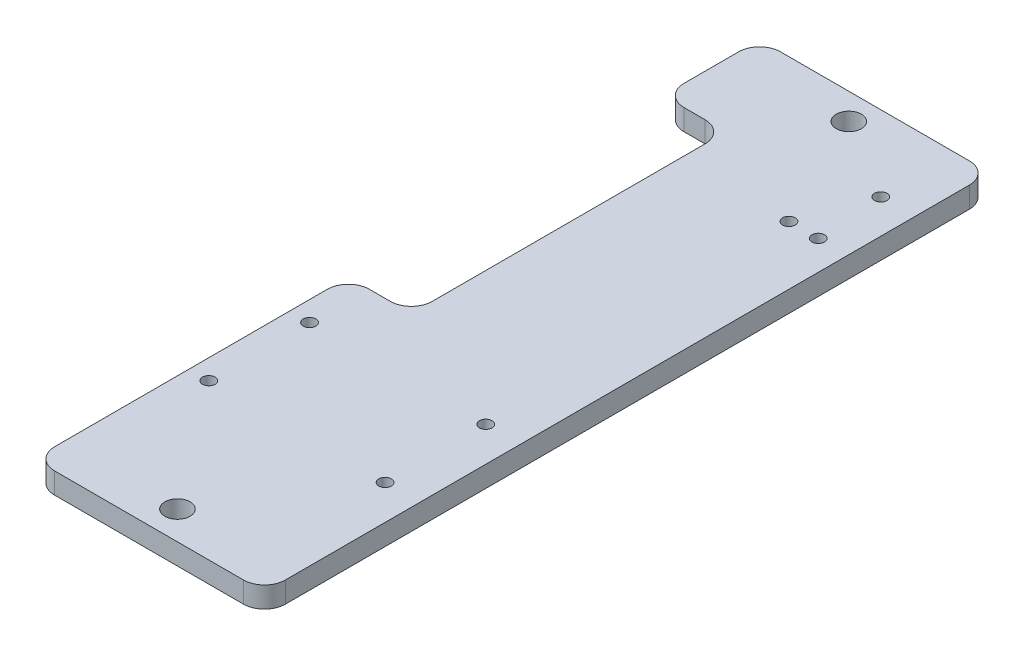
ISO-10303-21;
HEADER;
FILE_DESCRIPTION(('STEP AP214'),'2;1');
FILE_NAME('part.step','',(''),(''),'','','');
FILE_SCHEMA(('AUTOMOTIVE_DESIGN { 1 0 10303 214 1 1 1 1 }'));
ENDSEC;
DATA;
#1=APPLICATION_CONTEXT('core data for automotive mechanical design processes');
#2=APPLICATION_PROTOCOL_DEFINITION('international standard','automotive_design',2000,#1);
#3=PRODUCT_CONTEXT('',#1,'mechanical');
#4=PRODUCT('Part','Part','',(#3));
#5=PRODUCT_RELATED_PRODUCT_CATEGORY('part','',(#4));
#6=PRODUCT_DEFINITION_FORMATION('','',#4);
#7=PRODUCT_DEFINITION_CONTEXT('part definition',#1,'design');
#8=PRODUCT_DEFINITION('design','',#6,#7);
#9=PRODUCT_DEFINITION_SHAPE('','',#8);
#10=(LENGTH_UNIT() NAMED_UNIT(*) SI_UNIT(.MILLI.,.METRE.));
#11=(NAMED_UNIT(*) PLANE_ANGLE_UNIT() SI_UNIT($,.RADIAN.));
#12=(NAMED_UNIT(*) SI_UNIT($,.STERADIAN.) SOLID_ANGLE_UNIT());
#13=UNCERTAINTY_MEASURE_WITH_UNIT(LENGTH_MEASURE(1.E-05),#10,'distance_accuracy_value','');
#14=(GEOMETRIC_REPRESENTATION_CONTEXT(3) GLOBAL_UNCERTAINTY_ASSIGNED_CONTEXT((#13)) GLOBAL_UNIT_ASSIGNED_CONTEXT((#10,
#11,#12)) REPRESENTATION_CONTEXT('',''));
#15=CARTESIAN_POINT('',(0.,0.,0.));
#16=DIRECTION('',(0.,0.,1.));
#17=DIRECTION('',(1.,0.,0.));
#18=AXIS2_PLACEMENT_3D('',#15,#16,#17);
#19=CARTESIAN_POINT('',(0.,5.,0.));
#20=DIRECTION('',(0.,-1.,0.));
#21=DIRECTION('',(0.,0.,-1.));
#22=AXIS2_PLACEMENT_3D('',#19,#20,#21);
#23=PLANE('',#22);
#24=CARTESIAN_POINT('',(191.,5.,-126.));
#25=DIRECTION('',(0.,1.,0.));
#26=DIRECTION('',(0.,0.,1.));
#27=AXIS2_PLACEMENT_3D('',#24,#25,#26);
#28=CIRCLE('',#27,1.5);
#29=CARTESIAN_POINT('',(191.,5.,-124.5));
#30=VERTEX_POINT('',#29);
#31=EDGE_CURVE('E306',#30,#30,#28,.T.);
#32=ORIENTED_EDGE('',*,*,#31,.F.);
#33=EDGE_LOOP('',(#32));
#34=FACE_BOUND('',#33,.T.);
#35=CARTESIAN_POINT('',(196.89,5.,-142.));
#36=DIRECTION('',(0.,1.,0.));
#37=DIRECTION('',(0.,0.,1.));
#38=AXIS2_PLACEMENT_3D('',#35,#36,#37);
#39=CIRCLE('',#38,1.5);
#40=CARTESIAN_POINT('',(196.89,5.,-140.5));
#41=VERTEX_POINT('',#40);
#42=EDGE_CURVE('E310',#41,#41,#39,.T.);
#43=ORIENTED_EDGE('',*,*,#42,.F.);
#44=EDGE_LOOP('',(#43));
#45=FACE_BOUND('',#44,.T.);
#46=CARTESIAN_POINT('',(196.75,5.,-48.));
#47=DIRECTION('',(0.,1.,0.));
#48=DIRECTION('',(0.,0.,1.));
#49=AXIS2_PLACEMENT_3D('',#46,#47,#48);
#50=CIRCLE('',#49,1.5);
#51=CARTESIAN_POINT('',(196.75,5.,-46.5));
#52=VERTEX_POINT('',#51);
#53=EDGE_CURVE('E313',#52,#52,#50,.T.);
#54=ORIENTED_EDGE('',*,*,#53,.F.);
#55=EDGE_LOOP('',(#54));
#56=FACE_BOUND('',#55,.T.);
#57=CARTESIAN_POINT('',(154.75,5.,-48.));
#58=DIRECTION('',(0.,1.,0.));
#59=DIRECTION('',(0.,0.,1.));
#60=AXIS2_PLACEMENT_3D('',#57,#58,#59);
#61=CIRCLE('',#60,1.5);
#62=CARTESIAN_POINT('',(154.75,5.,-46.5));
#63=VERTEX_POINT('',#62);
#64=EDGE_CURVE('E316',#63,#63,#61,.T.);
#65=ORIENTED_EDGE('',*,*,#64,.F.);
#66=EDGE_LOOP('',(#65));
#67=FACE_BOUND('',#66,.T.);
#68=CARTESIAN_POINT('',(196.75,5.,-24.));
#69=DIRECTION('',(0.,1.,0.));
#70=DIRECTION('',(0.,0.,1.));
#71=AXIS2_PLACEMENT_3D('',#68,#69,#70);
#72=CIRCLE('',#71,1.5);
#73=CARTESIAN_POINT('',(196.75,5.,-22.5));
#74=VERTEX_POINT('',#73);
#75=EDGE_CURVE('E319',#74,#74,#72,.T.);
#76=ORIENTED_EDGE('',*,*,#75,.F.);
#77=EDGE_LOOP('',(#76));
#78=FACE_BOUND('',#77,.T.);
#79=CARTESIAN_POINT('',(154.75,5.,-24.));
#80=DIRECTION('',(0.,1.,0.));
#81=DIRECTION('',(0.,0.,1.));
#82=AXIS2_PLACEMENT_3D('',#79,#80,#81);
#83=CIRCLE('',#82,1.5);
#84=CARTESIAN_POINT('',(154.75,5.,-22.5));
#85=VERTEX_POINT('',#84);
#86=EDGE_CURVE('E303',#85,#85,#83,.T.);
#87=ORIENTED_EDGE('',*,*,#86,.F.);
#88=EDGE_LOOP('',(#87));
#89=FACE_BOUND('',#88,.T.);
#90=CARTESIAN_POINT('',(198.,5.,-126.));
#91=DIRECTION('',(0.,1.,0.));
#92=DIRECTION('',(0.,0.,1.));
#93=AXIS2_PLACEMENT_3D('',#90,#91,#92);
#94=CIRCLE('',#93,1.5);
#95=CARTESIAN_POINT('',(198.,5.,-124.5));
#96=VERTEX_POINT('',#95);
#97=EDGE_CURVE('E309',#96,#96,#94,.T.);
#98=ORIENTED_EDGE('',*,*,#97,.F.);
#99=EDGE_LOOP('',(#98));
#100=FACE_BOUND('',#99,.T.);
#101=CARTESIAN_POINT('',(177.5,5.,6.23000000000001));
#102=DIRECTION('',(0.,1.,0.));
#103=DIRECTION('',(0.,0.,-1.));
#104=AXIS2_PLACEMENT_3D('',#101,#102,#103);
#105=CIRCLE('',#104,2.99999999999999);
#106=CARTESIAN_POINT('',(177.5,5.,3.23000000000002));
#107=VERTEX_POINT('',#106);
#108=EDGE_CURVE('E287',#107,#107,#105,.T.);
#109=ORIENTED_EDGE('',*,*,#108,.F.);
#110=EDGE_LOOP('',(#109));
#111=FACE_BOUND('',#110,.T.);
#112=CARTESIAN_POINT('',(177.5,5.,-153.77));
#113=DIRECTION('',(0.,1.,0.));
#114=DIRECTION('',(0.,0.,1.));
#115=AXIS2_PLACEMENT_3D('',#112,#113,#114);
#116=CIRCLE('',#115,2.99999999999999);
#117=CARTESIAN_POINT('',(177.5,5.,-150.77));
#118=VERTEX_POINT('',#117);
#119=EDGE_CURVE('E290',#118,#118,#116,.T.);
#120=ORIENTED_EDGE('',*,*,#119,.F.);
#121=EDGE_LOOP('',(#120));
#122=FACE_BOUND('',#121,.T.);
#123=DIRECTION('',(1.,0.,0.));
#124=VECTOR('',#123,1.);
#125=CARTESIAN_POINT('',(150.,5.,-62.));
#126=LINE('',#125,#124);
#127=CARTESIAN_POINT('',(155.,5.,-62.));
#128=VERTEX_POINT('',#127);
#129=CARTESIAN_POINT('',(160.,5.,-62.));
#130=VERTEX_POINT('',#129);
#131=EDGE_CURVE('E245',#128,#130,#126,.T.);
#132=ORIENTED_EDGE('',*,*,#131,.F.);
#133=CARTESIAN_POINT('',(155.,5.,-57.));
#134=DIRECTION('',(0.,-1.,0.));
#135=DIRECTION('',(0.,0.,-1.));
#136=AXIS2_PLACEMENT_3D('',#133,#134,#135);
#137=CIRCLE('',#136,5.);
#138=CARTESIAN_POINT('',(150.,5.,-57.));
#139=VERTEX_POINT('',#138);
#140=EDGE_CURVE('E237',#128,#139,#137,.F.);
#141=ORIENTED_EDGE('',*,*,#140,.T.);
#142=DIRECTION('',(0.,0.,-1.));
#143=VECTOR('',#142,1.);
#144=CARTESIAN_POINT('',(150.,5.,-50.));
#145=LINE('',#144,#143);
#146=CARTESIAN_POINT('',(150.,5.,7.99999999999998));
#147=VERTEX_POINT('',#146);
#148=EDGE_CURVE('E153',#147,#139,#145,.T.);
#149=ORIENTED_EDGE('',*,*,#148,.F.);
#150=CARTESIAN_POINT('',(155.,5.,7.99999999999998));
#151=DIRECTION('',(0.,-1.,0.));
#152=DIRECTION('',(0.,0.,-1.));
#153=AXIS2_PLACEMENT_3D('',#150,#151,#152);
#154=CIRCLE('',#153,5.);
#155=CARTESIAN_POINT('',(155.,5.,13.));
#156=VERTEX_POINT('',#155);
#157=EDGE_CURVE('E148',#147,#156,#154,.F.);
#158=ORIENTED_EDGE('',*,*,#157,.T.);
#159=DIRECTION('',(1.,0.,0.));
#160=VECTOR('',#159,1.);
#161=CARTESIAN_POINT('',(150.,5.,13.));
#162=LINE('',#161,#160);
#163=CARTESIAN_POINT('',(200.,5.,13.));
#164=VERTEX_POINT('',#163);
#165=EDGE_CURVE('E151',#156,#164,#162,.T.);
#166=ORIENTED_EDGE('',*,*,#165,.T.);
#167=CARTESIAN_POINT('',(200.,5.,7.99999999999998));
#168=DIRECTION('',(0.,-1.,0.));
#169=DIRECTION('',(0.,0.,-1.));
#170=AXIS2_PLACEMENT_3D('',#167,#168,#169);
#171=CIRCLE('',#170,5.);
#172=CARTESIAN_POINT('',(205.,5.,7.99999999999998));
#173=VERTEX_POINT('',#172);
#174=EDGE_CURVE('E158',#164,#173,#171,.F.);
#175=ORIENTED_EDGE('',*,*,#174,.T.);
#176=DIRECTION('',(0.,0.,-1.));
#177=VECTOR('',#176,1.);
#178=CARTESIAN_POINT('',(205.,5.,5.));
#179=LINE('',#178,#177);
#180=CARTESIAN_POINT('',(205.,5.,-155.));
#181=VERTEX_POINT('',#180);
#182=EDGE_CURVE('E298',#173,#181,#179,.T.);
#183=ORIENTED_EDGE('',*,*,#182,.T.);
#184=CARTESIAN_POINT('',(200.,5.,-155.));
#185=DIRECTION('',(0.,-1.,0.));
#186=DIRECTION('',(0.,0.,-1.));
#187=AXIS2_PLACEMENT_3D('',#184,#185,#186);
#188=CIRCLE('',#187,5.);
#189=CARTESIAN_POINT('',(200.,5.,-160.));
#190=VERTEX_POINT('',#189);
#191=EDGE_CURVE('E178',#181,#190,#188,.F.);
#192=ORIENTED_EDGE('',*,*,#191,.T.);
#193=DIRECTION('',(1.,0.,0.));
#194=VECTOR('',#193,1.);
#195=CARTESIAN_POINT('',(150.,5.,-160.));
#196=LINE('',#195,#194);
#197=CARTESIAN_POINT('',(155.,5.,-160.));
#198=VERTEX_POINT('',#197);
#199=EDGE_CURVE('E278',#198,#190,#196,.T.);
#200=ORIENTED_EDGE('',*,*,#199,.F.);
#201=CARTESIAN_POINT('',(155.,5.,-155.));
#202=DIRECTION('',(0.,-1.,0.));
#203=DIRECTION('',(0.,0.,-1.));
#204=AXIS2_PLACEMENT_3D('',#201,#202,#203);
#205=CIRCLE('',#204,5.);
#206=CARTESIAN_POINT('',(150.,5.,-155.));
#207=VERTEX_POINT('',#206);
#208=EDGE_CURVE('E159',#198,#207,#205,.F.);
#209=ORIENTED_EDGE('',*,*,#208,.T.);
#210=CARTESIAN_POINT('',(150.,5.,-142.));
#211=VERTEX_POINT('',#210);
#212=EDGE_CURVE('E327',#211,#207,#145,.T.);
#213=ORIENTED_EDGE('',*,*,#212,.F.);
#214=CARTESIAN_POINT('',(155.,5.,-142.));
#215=DIRECTION('',(0.,-1.,0.));
#216=DIRECTION('',(0.,0.,-1.));
#217=AXIS2_PLACEMENT_3D('',#214,#215,#216);
#218=CIRCLE('',#217,5.);
#219=CARTESIAN_POINT('',(155.,5.,-137.));
#220=VERTEX_POINT('',#219);
#221=EDGE_CURVE('E235',#211,#220,#218,.F.);
#222=ORIENTED_EDGE('',*,*,#221,.T.);
#223=DIRECTION('',(1.,0.,0.));
#224=VECTOR('',#223,1.);
#225=CARTESIAN_POINT('',(150.,5.,-137.));
#226=LINE('',#225,#224);
#227=CARTESIAN_POINT('',(160.,5.,-137.));
#228=VERTEX_POINT('',#227);
#229=EDGE_CURVE('E693',#220,#228,#226,.T.);
#230=ORIENTED_EDGE('',*,*,#229,.T.);
#231=CARTESIAN_POINT('',(160.,5.,-132.));
#232=DIRECTION('',(0.,-1.,0.));
#233=DIRECTION('',(0.,0.,-1.));
#234=AXIS2_PLACEMENT_3D('',#231,#232,#233);
#235=CIRCLE('',#234,5.);
#236=CARTESIAN_POINT('',(165.,5.,-132.));
#237=VERTEX_POINT('',#236);
#238=EDGE_CURVE('E240',#228,#237,#235,.T.);
#239=ORIENTED_EDGE('',*,*,#238,.T.);
#240=DIRECTION('',(0.,0.,1.));
#241=VECTOR('',#240,1.);
#242=CARTESIAN_POINT('',(165.,5.,-137.));
#243=LINE('',#242,#241);
#244=CARTESIAN_POINT('',(165.,5.,-67.));
#245=VERTEX_POINT('',#244);
#246=EDGE_CURVE('E248',#237,#245,#243,.T.);
#247=ORIENTED_EDGE('',*,*,#246,.T.);
#248=CARTESIAN_POINT('',(160.,5.,-67.));
#249=DIRECTION('',(0.,-1.,0.));
#250=DIRECTION('',(0.,0.,-1.));
#251=AXIS2_PLACEMENT_3D('',#248,#249,#250);
#252=CIRCLE('',#251,5.);
#253=EDGE_CURVE('E43',#245,#130,#252,.T.);
#254=ORIENTED_EDGE('',*,*,#253,.T.);
#255=EDGE_LOOP('',(#132,#141,#149,#158,#166,#175,#183,#192,#200,#209,#213,#222,#230,#239,#247,#254));
#256=FACE_BOUND('',#255,.T.);
#257=ADVANCED_FACE('F35',(#34,#45,#56,#67,#78,#89,#100,#111,#122,#256),#23,.F.);
#258=CARTESIAN_POINT('',(0.,0.,0.));
#259=DIRECTION('',(0.,-1.,0.));
#260=DIRECTION('',(0.,0.,-1.));
#261=AXIS2_PLACEMENT_3D('',#258,#259,#260);
#262=PLANE('',#261);
#263=CARTESIAN_POINT('',(177.5,0.,-153.77));
#264=DIRECTION('',(0.,1.,0.));
#265=DIRECTION('',(0.,0.,1.));
#266=AXIS2_PLACEMENT_3D('',#263,#264,#265);
#267=CIRCLE('',#266,2.99999999999999);
#268=CARTESIAN_POINT('',(177.5,0.,-150.77));
#269=VERTEX_POINT('',#268);
#270=EDGE_CURVE('E170',#269,#269,#267,.T.);
#271=ORIENTED_EDGE('',*,*,#270,.T.);
#272=EDGE_LOOP('',(#271));
#273=FACE_BOUND('',#272,.T.);
#274=CARTESIAN_POINT('',(177.5,0.,6.23000000000001));
#275=DIRECTION('',(0.,1.,0.));
#276=DIRECTION('',(0.,0.,-1.));
#277=AXIS2_PLACEMENT_3D('',#274,#275,#276);
#278=CIRCLE('',#277,2.99999999999999);
#279=CARTESIAN_POINT('',(177.5,0.,3.23000000000002));
#280=VERTEX_POINT('',#279);
#281=EDGE_CURVE('E293',#280,#280,#278,.T.);
#282=ORIENTED_EDGE('',*,*,#281,.T.);
#283=EDGE_LOOP('',(#282));
#284=FACE_BOUND('',#283,.T.);
#285=CARTESIAN_POINT('',(198.,0.,-126.));
#286=DIRECTION('',(0.,-1.,0.));
#287=DIRECTION('',(0.,0.,-1.));
#288=AXIS2_PLACEMENT_3D('',#285,#286,#287);
#289=CIRCLE('',#288,1.5);
#290=CARTESIAN_POINT('',(198.,0.,-127.5));
#291=VERTEX_POINT('',#290);
#292=EDGE_CURVE('E326',#291,#291,#289,.T.);
#293=ORIENTED_EDGE('',*,*,#292,.F.);
#294=EDGE_LOOP('',(#293));
#295=FACE_BOUND('',#294,.T.);
#296=CARTESIAN_POINT('',(154.75,0.,-24.));
#297=DIRECTION('',(0.,-1.,0.));
#298=DIRECTION('',(0.,0.,-1.));
#299=AXIS2_PLACEMENT_3D('',#296,#297,#298);
#300=CIRCLE('',#299,1.5);
#301=CARTESIAN_POINT('',(154.75,0.,-25.5));
#302=VERTEX_POINT('',#301);
#303=EDGE_CURVE('E331',#302,#302,#300,.T.);
#304=ORIENTED_EDGE('',*,*,#303,.F.);
#305=EDGE_LOOP('',(#304));
#306=FACE_BOUND('',#305,.T.);
#307=CARTESIAN_POINT('',(196.75,0.,-24.));
#308=DIRECTION('',(0.,-1.,0.));
#309=DIRECTION('',(0.,0.,-1.));
#310=AXIS2_PLACEMENT_3D('',#307,#308,#309);
#311=CIRCLE('',#310,1.5);
#312=CARTESIAN_POINT('',(196.75,0.,-25.5));
#313=VERTEX_POINT('',#312);
#314=EDGE_CURVE('E334',#313,#313,#311,.T.);
#315=ORIENTED_EDGE('',*,*,#314,.F.);
#316=EDGE_LOOP('',(#315));
#317=FACE_BOUND('',#316,.T.);
#318=CARTESIAN_POINT('',(154.75,0.,-48.));
#319=DIRECTION('',(0.,-1.,0.));
#320=DIRECTION('',(0.,0.,-1.));
#321=AXIS2_PLACEMENT_3D('',#318,#319,#320);
#322=CIRCLE('',#321,1.5);
#323=CARTESIAN_POINT('',(154.75,0.,-49.5));
#324=VERTEX_POINT('',#323);
#325=EDGE_CURVE('E337',#324,#324,#322,.T.);
#326=ORIENTED_EDGE('',*,*,#325,.F.);
#327=EDGE_LOOP('',(#326));
#328=FACE_BOUND('',#327,.T.);
#329=CARTESIAN_POINT('',(196.75,0.,-48.));
#330=DIRECTION('',(0.,-1.,0.));
#331=DIRECTION('',(0.,0.,-1.));
#332=AXIS2_PLACEMENT_3D('',#329,#330,#331);
#333=CIRCLE('',#332,1.5);
#334=CARTESIAN_POINT('',(196.75,0.,-49.5));
#335=VERTEX_POINT('',#334);
#336=EDGE_CURVE('E340',#335,#335,#333,.T.);
#337=ORIENTED_EDGE('',*,*,#336,.F.);
#338=EDGE_LOOP('',(#337));
#339=FACE_BOUND('',#338,.T.);
#340=CARTESIAN_POINT('',(196.89,0.,-142.));
#341=DIRECTION('',(0.,-1.,0.));
#342=DIRECTION('',(0.,0.,-1.));
#343=AXIS2_PLACEMENT_3D('',#340,#341,#342);
#344=CIRCLE('',#343,1.5);
#345=CARTESIAN_POINT('',(196.89,0.,-143.5));
#346=VERTEX_POINT('',#345);
#347=EDGE_CURVE('E342',#346,#346,#344,.T.);
#348=ORIENTED_EDGE('',*,*,#347,.F.);
#349=EDGE_LOOP('',(#348));
#350=FACE_BOUND('',#349,.T.);
#351=CARTESIAN_POINT('',(191.,0.,-126.));
#352=DIRECTION('',(0.,-1.,0.));
#353=DIRECTION('',(0.,0.,-1.));
#354=AXIS2_PLACEMENT_3D('',#351,#352,#353);
#355=CIRCLE('',#354,1.5);
#356=CARTESIAN_POINT('',(191.,0.,-127.5));
#357=VERTEX_POINT('',#356);
#358=EDGE_CURVE('E183',#357,#357,#355,.T.);
#359=ORIENTED_EDGE('',*,*,#358,.F.);
#360=EDGE_LOOP('',(#359));
#361=FACE_BOUND('',#360,.T.);
#362=DIRECTION('',(0.,0.,1.));
#363=VECTOR('',#362,1.);
#364=CARTESIAN_POINT('',(150.,0.,0.));
#365=LINE('',#364,#363);
#366=CARTESIAN_POINT('',(150.,0.,-57.));
#367=VERTEX_POINT('',#366);
#368=CARTESIAN_POINT('',(150.,0.,7.99999999999998));
#369=VERTEX_POINT('',#368);
#370=EDGE_CURVE('E180',#367,#369,#365,.T.);
#371=ORIENTED_EDGE('',*,*,#370,.F.);
#372=CARTESIAN_POINT('',(155.,0.,-57.));
#373=DIRECTION('',(0.,-1.,0.));
#374=DIRECTION('',(0.,0.,-1.));
#375=AXIS2_PLACEMENT_3D('',#372,#373,#374);
#376=CIRCLE('',#375,5.);
#377=CARTESIAN_POINT('',(155.,0.,-62.));
#378=VERTEX_POINT('',#377);
#379=EDGE_CURVE('E233',#367,#378,#376,.T.);
#380=ORIENTED_EDGE('',*,*,#379,.T.);
#381=DIRECTION('',(-1.,0.,0.));
#382=VECTOR('',#381,1.);
#383=CARTESIAN_POINT('',(0.,0.,-61.9999999999999));
#384=LINE('',#383,#382);
#385=CARTESIAN_POINT('',(160.,0.,-62.));
#386=VERTEX_POINT('',#385);
#387=EDGE_CURVE('E257',#386,#378,#384,.T.);
#388=ORIENTED_EDGE('',*,*,#387,.F.);
#389=CARTESIAN_POINT('',(160.,0.,-67.));
#390=DIRECTION('',(0.,-1.,0.));
#391=DIRECTION('',(0.,0.,-1.));
#392=AXIS2_PLACEMENT_3D('',#389,#390,#391);
#393=CIRCLE('',#392,5.);
#394=CARTESIAN_POINT('',(165.,0.,-67.));
#395=VERTEX_POINT('',#394);
#396=EDGE_CURVE('E12',#386,#395,#393,.F.);
#397=ORIENTED_EDGE('',*,*,#396,.T.);
#398=DIRECTION('',(0.,0.,-1.));
#399=VECTOR('',#398,1.);
#400=CARTESIAN_POINT('',(165.,0.,0.));
#401=LINE('',#400,#399);
#402=CARTESIAN_POINT('',(165.,0.,-132.));
#403=VERTEX_POINT('',#402);
#404=EDGE_CURVE('E211',#395,#403,#401,.T.);
#405=ORIENTED_EDGE('',*,*,#404,.T.);
#406=CARTESIAN_POINT('',(160.,0.,-132.));
#407=DIRECTION('',(0.,-1.,0.));
#408=DIRECTION('',(0.,0.,-1.));
#409=AXIS2_PLACEMENT_3D('',#406,#407,#408);
#410=CIRCLE('',#409,5.);
#411=CARTESIAN_POINT('',(160.,0.,-137.));
#412=VERTEX_POINT('',#411);
#413=EDGE_CURVE('E242',#403,#412,#410,.F.);
#414=ORIENTED_EDGE('',*,*,#413,.T.);
#415=DIRECTION('',(-1.,0.,0.));
#416=VECTOR('',#415,1.);
#417=CARTESIAN_POINT('',(0.,0.,-137.));
#418=LINE('',#417,#416);
#419=CARTESIAN_POINT('',(155.,0.,-137.));
#420=VERTEX_POINT('',#419);
#421=EDGE_CURVE('E272',#412,#420,#418,.T.);
#422=ORIENTED_EDGE('',*,*,#421,.T.);
#423=CARTESIAN_POINT('',(155.,0.,-142.));
#424=DIRECTION('',(0.,-1.,0.));
#425=DIRECTION('',(0.,0.,-1.));
#426=AXIS2_PLACEMENT_3D('',#423,#424,#425);
#427=CIRCLE('',#426,5.);
#428=CARTESIAN_POINT('',(150.,0.,-142.));
#429=VERTEX_POINT('',#428);
#430=EDGE_CURVE('E58',#420,#429,#427,.T.);
#431=ORIENTED_EDGE('',*,*,#430,.T.);
#432=CARTESIAN_POINT('',(150.,0.,-155.));
#433=VERTEX_POINT('',#432);
#434=EDGE_CURVE('E176',#433,#429,#365,.T.);
#435=ORIENTED_EDGE('',*,*,#434,.F.);
#436=CARTESIAN_POINT('',(155.,0.,-155.));
#437=DIRECTION('',(0.,-1.,0.));
#438=DIRECTION('',(0.,0.,-1.));
#439=AXIS2_PLACEMENT_3D('',#436,#437,#438);
#440=CIRCLE('',#439,5.);
#441=CARTESIAN_POINT('',(155.,0.,-160.));
#442=VERTEX_POINT('',#441);
#443=EDGE_CURVE('E197',#433,#442,#440,.T.);
#444=ORIENTED_EDGE('',*,*,#443,.T.);
#445=DIRECTION('',(-1.,0.,0.));
#446=VECTOR('',#445,1.);
#447=CARTESIAN_POINT('',(0.,0.,-160.));
#448=LINE('',#447,#446);
#449=CARTESIAN_POINT('',(200.,0.,-160.));
#450=VERTEX_POINT('',#449);
#451=EDGE_CURVE('E281',#450,#442,#448,.T.);
#452=ORIENTED_EDGE('',*,*,#451,.F.);
#453=CARTESIAN_POINT('',(200.,0.,-155.));
#454=DIRECTION('',(0.,-1.,0.));
#455=DIRECTION('',(0.,0.,-1.));
#456=AXIS2_PLACEMENT_3D('',#453,#454,#455);
#457=CIRCLE('',#456,5.);
#458=CARTESIAN_POINT('',(205.,0.,-155.));
#459=VERTEX_POINT('',#458);
#460=EDGE_CURVE('E195',#450,#459,#457,.T.);
#461=ORIENTED_EDGE('',*,*,#460,.T.);
#462=DIRECTION('',(0.,0.,-1.));
#463=VECTOR('',#462,1.);
#464=CARTESIAN_POINT('',(205.,0.,5.));
#465=LINE('',#464,#463);
#466=CARTESIAN_POINT('',(205.,0.,7.99999999999998));
#467=VERTEX_POINT('',#466);
#468=EDGE_CURVE('E300',#467,#459,#465,.T.);
#469=ORIENTED_EDGE('',*,*,#468,.F.);
#470=CARTESIAN_POINT('',(200.,0.,7.99999999999998));
#471=DIRECTION('',(0.,-1.,0.));
#472=DIRECTION('',(0.,0.,-1.));
#473=AXIS2_PLACEMENT_3D('',#470,#471,#472);
#474=CIRCLE('',#473,5.);
#475=CARTESIAN_POINT('',(200.,0.,13.));
#476=VERTEX_POINT('',#475);
#477=EDGE_CURVE('E200',#467,#476,#474,.T.);
#478=ORIENTED_EDGE('',*,*,#477,.T.);
#479=DIRECTION('',(1.,0.,0.));
#480=VECTOR('',#479,1.);
#481=CARTESIAN_POINT('',(150.,0.,13.));
#482=LINE('',#481,#480);
#483=CARTESIAN_POINT('',(155.,0.,13.));
#484=VERTEX_POINT('',#483);
#485=EDGE_CURVE('E169',#484,#476,#482,.T.);
#486=ORIENTED_EDGE('',*,*,#485,.F.);
#487=CARTESIAN_POINT('',(155.,0.,7.99999999999998));
#488=DIRECTION('',(0.,-1.,0.));
#489=DIRECTION('',(0.,0.,-1.));
#490=AXIS2_PLACEMENT_3D('',#487,#488,#489);
#491=CIRCLE('',#490,5.);
#492=EDGE_CURVE('E175',#484,#369,#491,.T.);
#493=ORIENTED_EDGE('',*,*,#492,.T.);
#494=EDGE_LOOP('',(#371,#380,#388,#397,#405,#414,#422,#431,#435,#444,#452,#461,#469,#478,#486,#493));
#495=FACE_BOUND('',#494,.T.);
#496=ADVANCED_FACE('F263',(#273,#284,#295,#306,#317,#328,#339,#350,#361,#495),#262,.T.);
#497=CARTESIAN_POINT('',(150.,-5.,-50.));
#498=DIRECTION('',(1.,0.,0.));
#499=DIRECTION('',(0.,0.,-1.));
#500=AXIS2_PLACEMENT_3D('',#497,#498,#499);
#501=PLANE('',#500);
#502=ORIENTED_EDGE('',*,*,#434,.T.);
#503=DIRECTION('',(0.,-1.,0.));
#504=VECTOR('',#503,1.);
#505=CARTESIAN_POINT('',(150.,5.,-142.));
#506=LINE('',#505,#504);
#507=EDGE_CURVE('E50',#429,#211,#506,.F.);
#508=ORIENTED_EDGE('',*,*,#507,.T.);
#509=ORIENTED_EDGE('',*,*,#212,.T.);
#510=DIRECTION('',(0.,1.,0.));
#511=VECTOR('',#510,1.);
#512=CARTESIAN_POINT('',(150.,-5.,-155.));
#513=LINE('',#512,#511);
#514=EDGE_CURVE('E202',#207,#433,#513,.F.);
#515=ORIENTED_EDGE('',*,*,#514,.T.);
#516=EDGE_LOOP('',(#502,#508,#509,#515));
#517=FACE_BOUND('',#516,.T.);
#518=ADVANCED_FACE('F349',(#517),#501,.F.);
#519=CARTESIAN_POINT('',(205.,0.,5.));
#520=DIRECTION('',(1.,0.,0.));
#521=DIRECTION('',(0.,0.,-1.));
#522=AXIS2_PLACEMENT_3D('',#519,#520,#521);
#523=PLANE('',#522);
#524=ORIENTED_EDGE('',*,*,#182,.F.);
#525=DIRECTION('',(0.,1.,0.));
#526=VECTOR('',#525,1.);
#527=CARTESIAN_POINT('',(205.,0.,7.99999999999998));
#528=LINE('',#527,#526);
#529=EDGE_CURVE('E193',#173,#467,#528,.F.);
#530=ORIENTED_EDGE('',*,*,#529,.T.);
#531=ORIENTED_EDGE('',*,*,#468,.T.);
#532=DIRECTION('',(0.,1.,0.));
#533=VECTOR('',#532,1.);
#534=CARTESIAN_POINT('',(205.,5.,-155.));
#535=LINE('',#534,#533);
#536=EDGE_CURVE('E190',#459,#181,#535,.T.);
#537=ORIENTED_EDGE('',*,*,#536,.T.);
#538=EDGE_LOOP('',(#524,#530,#531,#537));
#539=FACE_BOUND('',#538,.T.);
#540=ADVANCED_FACE('F369',(#539),#523,.T.);
#541=ORIENTED_EDGE('',*,*,#148,.T.);
#542=DIRECTION('',(0.,-1.,0.));
#543=VECTOR('',#542,1.);
#544=CARTESIAN_POINT('',(150.,-5.,-57.));
#545=LINE('',#544,#543);
#546=EDGE_CURVE('E229',#139,#367,#545,.T.);
#547=ORIENTED_EDGE('',*,*,#546,.T.);
#548=ORIENTED_EDGE('',*,*,#370,.T.);
#549=DIRECTION('',(0.,1.,0.));
#550=VECTOR('',#549,1.);
#551=CARTESIAN_POINT('',(150.,5.,7.99999999999998));
#552=LINE('',#551,#550);
#553=EDGE_CURVE('E204',#369,#147,#552,.T.);
#554=ORIENTED_EDGE('',*,*,#553,.T.);
#555=EDGE_LOOP('',(#541,#547,#548,#554));
#556=FACE_BOUND('',#555,.T.);
#557=ADVANCED_FACE('F374',(#556),#501,.F.);
#558=CARTESIAN_POINT('',(198.,-5.,-126.));
#559=DIRECTION('',(0.,1.,0.));
#560=DIRECTION('',(0.,0.,1.));
#561=AXIS2_PLACEMENT_3D('',#558,#559,#560);
#562=CYLINDRICAL_SURFACE('',#561,1.5);
#563=ORIENTED_EDGE('',*,*,#292,.T.);
#564=EDGE_LOOP('',(#563));
#565=FACE_BOUND('',#564,.T.);
#566=ORIENTED_EDGE('',*,*,#97,.T.);
#567=EDGE_LOOP('',(#566));
#568=FACE_BOUND('',#567,.T.);
#569=ADVANCED_FACE('F453',(#565,#568),#562,.F.);
#570=CARTESIAN_POINT('',(154.75,-5.,-24.));
#571=DIRECTION('',(0.,1.,0.));
#572=DIRECTION('',(0.,0.,1.));
#573=AXIS2_PLACEMENT_3D('',#570,#571,#572);
#574=CYLINDRICAL_SURFACE('',#573,1.5);
#575=ORIENTED_EDGE('',*,*,#303,.T.);
#576=EDGE_LOOP('',(#575));
#577=FACE_BOUND('',#576,.T.);
#578=ORIENTED_EDGE('',*,*,#86,.T.);
#579=EDGE_LOOP('',(#578));
#580=FACE_BOUND('',#579,.T.);
#581=ADVANCED_FACE('F450',(#577,#580),#574,.F.);
#582=CARTESIAN_POINT('',(196.75,-5.,-24.));
#583=DIRECTION('',(0.,1.,0.));
#584=DIRECTION('',(0.,0.,1.));
#585=AXIS2_PLACEMENT_3D('',#582,#583,#584);
#586=CYLINDRICAL_SURFACE('',#585,1.5);
#587=ORIENTED_EDGE('',*,*,#314,.T.);
#588=EDGE_LOOP('',(#587));
#589=FACE_BOUND('',#588,.T.);
#590=ORIENTED_EDGE('',*,*,#75,.T.);
#591=EDGE_LOOP('',(#590));
#592=FACE_BOUND('',#591,.T.);
#593=ADVANCED_FACE('F446',(#589,#592),#586,.F.);
#594=CARTESIAN_POINT('',(154.75,-5.,-48.));
#595=DIRECTION('',(0.,1.,0.));
#596=DIRECTION('',(0.,0.,1.));
#597=AXIS2_PLACEMENT_3D('',#594,#595,#596);
#598=CYLINDRICAL_SURFACE('',#597,1.5);
#599=ORIENTED_EDGE('',*,*,#325,.T.);
#600=EDGE_LOOP('',(#599));
#601=FACE_BOUND('',#600,.T.);
#602=ORIENTED_EDGE('',*,*,#64,.T.);
#603=EDGE_LOOP('',(#602));
#604=FACE_BOUND('',#603,.T.);
#605=ADVANCED_FACE('F442',(#601,#604),#598,.F.);
#606=CARTESIAN_POINT('',(196.75,-5.,-48.));
#607=DIRECTION('',(0.,1.,0.));
#608=DIRECTION('',(0.,0.,1.));
#609=AXIS2_PLACEMENT_3D('',#606,#607,#608);
#610=CYLINDRICAL_SURFACE('',#609,1.5);
#611=ORIENTED_EDGE('',*,*,#336,.T.);
#612=EDGE_LOOP('',(#611));
#613=FACE_BOUND('',#612,.T.);
#614=ORIENTED_EDGE('',*,*,#53,.T.);
#615=EDGE_LOOP('',(#614));
#616=FACE_BOUND('',#615,.T.);
#617=ADVANCED_FACE('F439',(#613,#616),#610,.F.);
#618=CARTESIAN_POINT('',(196.89,-5.,-142.));
#619=DIRECTION('',(0.,1.,0.));
#620=DIRECTION('',(0.,0.,1.));
#621=AXIS2_PLACEMENT_3D('',#618,#619,#620);
#622=CYLINDRICAL_SURFACE('',#621,1.5);
#623=ORIENTED_EDGE('',*,*,#347,.T.);
#624=EDGE_LOOP('',(#623));
#625=FACE_BOUND('',#624,.T.);
#626=ORIENTED_EDGE('',*,*,#42,.T.);
#627=EDGE_LOOP('',(#626));
#628=FACE_BOUND('',#627,.T.);
#629=ADVANCED_FACE('F436',(#625,#628),#622,.F.);
#630=CARTESIAN_POINT('',(191.,-5.,-126.));
#631=DIRECTION('',(0.,1.,0.));
#632=DIRECTION('',(0.,0.,1.));
#633=AXIS2_PLACEMENT_3D('',#630,#631,#632);
#634=CYLINDRICAL_SURFACE('',#633,1.5);
#635=ORIENTED_EDGE('',*,*,#358,.T.);
#636=EDGE_LOOP('',(#635));
#637=FACE_BOUND('',#636,.T.);
#638=ORIENTED_EDGE('',*,*,#31,.T.);
#639=EDGE_LOOP('',(#638));
#640=FACE_BOUND('',#639,.T.);
#641=ADVANCED_FACE('F431',(#637,#640),#634,.F.);
#642=CARTESIAN_POINT('',(150.,0.,13.));
#643=DIRECTION('',(0.,0.,1.));
#644=DIRECTION('',(1.,0.,0.));
#645=AXIS2_PLACEMENT_3D('',#642,#643,#644);
#646=PLANE('',#645);
#647=ORIENTED_EDGE('',*,*,#485,.T.);
#648=DIRECTION('',(0.,1.,0.));
#649=VECTOR('',#648,1.);
#650=CARTESIAN_POINT('',(200.,0.,13.));
#651=LINE('',#650,#649);
#652=EDGE_CURVE('E168',#476,#164,#651,.T.);
#653=ORIENTED_EDGE('',*,*,#652,.T.);
#654=ORIENTED_EDGE('',*,*,#165,.F.);
#655=DIRECTION('',(0.,1.,0.));
#656=VECTOR('',#655,1.);
#657=CARTESIAN_POINT('',(155.,0.,13.));
#658=LINE('',#657,#656);
#659=EDGE_CURVE('E165',#156,#484,#658,.F.);
#660=ORIENTED_EDGE('',*,*,#659,.T.);
#661=EDGE_LOOP('',(#647,#653,#654,#660));
#662=FACE_BOUND('',#661,.T.);
#663=ADVANCED_FACE('F164',(#662),#646,.T.);
#664=CARTESIAN_POINT('',(177.5,0.,6.23000000000001));
#665=DIRECTION('',(0.,1.,0.));
#666=DIRECTION('',(0.,0.,1.));
#667=AXIS2_PLACEMENT_3D('',#664,#665,#666);
#668=CYLINDRICAL_SURFACE('',#667,2.99999999999999);
#669=ORIENTED_EDGE('',*,*,#281,.F.);
#670=EDGE_LOOP('',(#669));
#671=FACE_BOUND('',#670,.T.);
#672=ORIENTED_EDGE('',*,*,#108,.T.);
#673=EDGE_LOOP('',(#672));
#674=FACE_BOUND('',#673,.T.);
#675=ADVANCED_FACE('F424',(#671,#674),#668,.F.);
#676=CARTESIAN_POINT('',(177.5,0.,-153.77));
#677=DIRECTION('',(0.,1.,0.));
#678=DIRECTION('',(0.,0.,1.));
#679=AXIS2_PLACEMENT_3D('',#676,#677,#678);
#680=CYLINDRICAL_SURFACE('',#679,2.99999999999999);
#681=ORIENTED_EDGE('',*,*,#270,.F.);
#682=EDGE_LOOP('',(#681));
#683=FACE_BOUND('',#682,.T.);
#684=ORIENTED_EDGE('',*,*,#119,.T.);
#685=EDGE_LOOP('',(#684));
#686=FACE_BOUND('',#685,.T.);
#687=ADVANCED_FACE('F421',(#683,#686),#680,.F.);
#688=CARTESIAN_POINT('',(150.,-34.,-160.));
#689=DIRECTION('',(0.,0.,1.));
#690=DIRECTION('',(1.,0.,0.));
#691=AXIS2_PLACEMENT_3D('',#688,#689,#690);
#692=PLANE('',#691);
#693=ORIENTED_EDGE('',*,*,#451,.T.);
#694=DIRECTION('',(0.,1.,0.));
#695=VECTOR('',#694,1.);
#696=CARTESIAN_POINT('',(155.,-34.,-160.));
#697=LINE('',#696,#695);
#698=EDGE_CURVE('E208',#442,#198,#697,.T.);
#699=ORIENTED_EDGE('',*,*,#698,.T.);
#700=ORIENTED_EDGE('',*,*,#199,.T.);
#701=DIRECTION('',(0.,1.,0.));
#702=VECTOR('',#701,1.);
#703=CARTESIAN_POINT('',(200.,0.,-160.));
#704=LINE('',#703,#702);
#705=EDGE_CURVE('E206',#190,#450,#704,.F.);
#706=ORIENTED_EDGE('',*,*,#705,.T.);
#707=EDGE_LOOP('',(#693,#699,#700,#706));
#708=FACE_BOUND('',#707,.T.);
#709=ADVANCED_FACE('F360',(#708),#692,.F.);
#710=CARTESIAN_POINT('',(200.,0.,7.99999999999998));
#711=DIRECTION('',(0.,1.,0.));
#712=DIRECTION('',(0.,0.,1.));
#713=AXIS2_PLACEMENT_3D('',#710,#711,#712);
#714=CYLINDRICAL_SURFACE('',#713,5.);
#715=ORIENTED_EDGE('',*,*,#477,.F.);
#716=ORIENTED_EDGE('',*,*,#529,.F.);
#717=ORIENTED_EDGE('',*,*,#174,.F.);
#718=ORIENTED_EDGE('',*,*,#652,.F.);
#719=EDGE_LOOP('',(#715,#716,#717,#718));
#720=FACE_BOUND('',#719,.T.);
#721=ADVANCED_FACE('F372',(#720),#714,.T.);
#722=CARTESIAN_POINT('',(155.,-5.,7.99999999999998));
#723=DIRECTION('',(0.,-1.,0.));
#724=DIRECTION('',(0.,0.,-1.));
#725=AXIS2_PLACEMENT_3D('',#722,#723,#724);
#726=CYLINDRICAL_SURFACE('',#725,5.);
#727=ORIENTED_EDGE('',*,*,#492,.F.);
#728=ORIENTED_EDGE('',*,*,#659,.F.);
#729=ORIENTED_EDGE('',*,*,#157,.F.);
#730=ORIENTED_EDGE('',*,*,#553,.F.);
#731=EDGE_LOOP('',(#727,#728,#729,#730));
#732=FACE_BOUND('',#731,.T.);
#733=ADVANCED_FACE('F173',(#732),#726,.T.);
#734=CARTESIAN_POINT('',(155.,-34.,-155.));
#735=DIRECTION('',(0.,1.,0.));
#736=DIRECTION('',(0.,0.,1.));
#737=AXIS2_PLACEMENT_3D('',#734,#735,#736);
#738=CYLINDRICAL_SURFACE('',#737,5.);
#739=ORIENTED_EDGE('',*,*,#443,.F.);
#740=ORIENTED_EDGE('',*,*,#514,.F.);
#741=ORIENTED_EDGE('',*,*,#208,.F.);
#742=ORIENTED_EDGE('',*,*,#698,.F.);
#743=EDGE_LOOP('',(#739,#740,#741,#742));
#744=FACE_BOUND('',#743,.T.);
#745=ADVANCED_FACE('F356',(#744),#738,.T.);
#746=CARTESIAN_POINT('',(200.,0.,-155.));
#747=DIRECTION('',(0.,-1.,0.));
#748=DIRECTION('',(0.,0.,-1.));
#749=AXIS2_PLACEMENT_3D('',#746,#747,#748);
#750=CYLINDRICAL_SURFACE('',#749,5.);
#751=ORIENTED_EDGE('',*,*,#460,.F.);
#752=ORIENTED_EDGE('',*,*,#705,.F.);
#753=ORIENTED_EDGE('',*,*,#191,.F.);
#754=ORIENTED_EDGE('',*,*,#536,.F.);
#755=EDGE_LOOP('',(#751,#752,#753,#754));
#756=FACE_BOUND('',#755,.T.);
#757=ADVANCED_FACE('F363',(#756),#750,.T.);
#758=CARTESIAN_POINT('',(150.,-5.,-137.));
#759=DIRECTION('',(0.,0.,1.));
#760=DIRECTION('',(1.,0.,0.));
#761=AXIS2_PLACEMENT_3D('',#758,#759,#760);
#762=PLANE('',#761);
#763=ORIENTED_EDGE('',*,*,#421,.F.);
#764=DIRECTION('',(0.,1.,0.));
#765=VECTOR('',#764,1.);
#766=CARTESIAN_POINT('',(160.,5.,-137.));
#767=LINE('',#766,#765);
#768=EDGE_CURVE('E217',#412,#228,#767,.T.);
#769=ORIENTED_EDGE('',*,*,#768,.T.);
#770=ORIENTED_EDGE('',*,*,#229,.F.);
#771=DIRECTION('',(0.,-1.,0.));
#772=VECTOR('',#771,1.);
#773=CARTESIAN_POINT('',(155.,0.,-137.));
#774=LINE('',#773,#772);
#775=EDGE_CURVE('E214',#220,#420,#774,.T.);
#776=ORIENTED_EDGE('',*,*,#775,.T.);
#777=EDGE_LOOP('',(#763,#769,#770,#776));
#778=FACE_BOUND('',#777,.T.);
#779=ADVANCED_FACE('F274',(#778),#762,.T.);
#780=CARTESIAN_POINT('',(165.,-5.,-137.));
#781=DIRECTION('',(-1.,0.,0.));
#782=DIRECTION('',(0.,0.,1.));
#783=AXIS2_PLACEMENT_3D('',#780,#781,#782);
#784=PLANE('',#783);
#785=ORIENTED_EDGE('',*,*,#246,.F.);
#786=DIRECTION('',(0.,1.,0.));
#787=VECTOR('',#786,1.);
#788=CARTESIAN_POINT('',(165.,0.,-132.));
#789=LINE('',#788,#787);
#790=EDGE_CURVE('E223',#237,#403,#789,.F.);
#791=ORIENTED_EDGE('',*,*,#790,.T.);
#792=ORIENTED_EDGE('',*,*,#404,.F.);
#793=DIRECTION('',(0.,1.,0.));
#794=VECTOR('',#793,1.);
#795=CARTESIAN_POINT('',(165.,-5.,-67.));
#796=LINE('',#795,#794);
#797=EDGE_CURVE('E220',#395,#245,#796,.T.);
#798=ORIENTED_EDGE('',*,*,#797,.T.);
#799=EDGE_LOOP('',(#785,#791,#792,#798));
#800=FACE_BOUND('',#799,.T.);
#801=ADVANCED_FACE('F266',(#800),#784,.T.);
#802=CARTESIAN_POINT('',(150.,-5.,-62.));
#803=DIRECTION('',(0.,0.,1.));
#804=DIRECTION('',(1.,0.,0.));
#805=AXIS2_PLACEMENT_3D('',#802,#803,#804);
#806=PLANE('',#805);
#807=ORIENTED_EDGE('',*,*,#131,.T.);
#808=DIRECTION('',(0.,1.,0.));
#809=VECTOR('',#808,1.);
#810=CARTESIAN_POINT('',(160.,-5.,-62.));
#811=LINE('',#810,#809);
#812=EDGE_CURVE('E227',#130,#386,#811,.F.);
#813=ORIENTED_EDGE('',*,*,#812,.T.);
#814=ORIENTED_EDGE('',*,*,#387,.T.);
#815=DIRECTION('',(0.,-1.,0.));
#816=VECTOR('',#815,1.);
#817=CARTESIAN_POINT('',(155.,-5.,-62.));
#818=LINE('',#817,#816);
#819=EDGE_CURVE('E225',#378,#128,#818,.F.);
#820=ORIENTED_EDGE('',*,*,#819,.T.);
#821=EDGE_LOOP('',(#807,#813,#814,#820));
#822=FACE_BOUND('',#821,.T.);
#823=ADVANCED_FACE('F253',(#822),#806,.F.);
#824=CARTESIAN_POINT('',(160.,-5.,-132.));
#825=DIRECTION('',(0.,-1.,0.));
#826=DIRECTION('',(0.,0.,-1.));
#827=AXIS2_PLACEMENT_3D('',#824,#825,#826);
#828=CYLINDRICAL_SURFACE('',#827,5.);
#829=ORIENTED_EDGE('',*,*,#413,.F.);
#830=ORIENTED_EDGE('',*,*,#790,.F.);
#831=ORIENTED_EDGE('',*,*,#238,.F.);
#832=ORIENTED_EDGE('',*,*,#768,.F.);
#833=EDGE_LOOP('',(#829,#830,#831,#832));
#834=FACE_BOUND('',#833,.T.);
#835=ADVANCED_FACE('F269',(#834),#828,.F.);
#836=CARTESIAN_POINT('',(160.,-5.,-67.));
#837=DIRECTION('',(0.,1.,0.));
#838=DIRECTION('',(0.,0.,1.));
#839=AXIS2_PLACEMENT_3D('',#836,#837,#838);
#840=CYLINDRICAL_SURFACE('',#839,5.);
#841=ORIENTED_EDGE('',*,*,#396,.F.);
#842=ORIENTED_EDGE('',*,*,#812,.F.);
#843=ORIENTED_EDGE('',*,*,#253,.F.);
#844=ORIENTED_EDGE('',*,*,#797,.F.);
#845=EDGE_LOOP('',(#841,#842,#843,#844));
#846=FACE_BOUND('',#845,.T.);
#847=ADVANCED_FACE('F260',(#846),#840,.F.);
#848=CARTESIAN_POINT('',(155.,-5.,-57.));
#849=DIRECTION('',(0.,-1.,0.));
#850=DIRECTION('',(0.,0.,-1.));
#851=AXIS2_PLACEMENT_3D('',#848,#849,#850);
#852=CYLINDRICAL_SURFACE('',#851,5.);
#853=ORIENTED_EDGE('',*,*,#140,.F.);
#854=ORIENTED_EDGE('',*,*,#819,.F.);
#855=ORIENTED_EDGE('',*,*,#379,.F.);
#856=ORIENTED_EDGE('',*,*,#546,.F.);
#857=EDGE_LOOP('',(#853,#854,#855,#856));
#858=FACE_BOUND('',#857,.T.);
#859=ADVANCED_FACE('F377',(#858),#852,.T.);
#860=CARTESIAN_POINT('',(155.,-5.,-142.));
#861=DIRECTION('',(0.,1.,0.));
#862=DIRECTION('',(0.,0.,1.));
#863=AXIS2_PLACEMENT_3D('',#860,#861,#862);
#864=CYLINDRICAL_SURFACE('',#863,5.);
#865=ORIENTED_EDGE('',*,*,#221,.F.);
#866=ORIENTED_EDGE('',*,*,#507,.F.);
#867=ORIENTED_EDGE('',*,*,#430,.F.);
#868=ORIENTED_EDGE('',*,*,#775,.F.);
#869=EDGE_LOOP('',(#865,#866,#867,#868));
#870=FACE_BOUND('',#869,.T.);
#871=ADVANCED_FACE('F37',(#870),#864,.T.);
#872=CLOSED_SHELL('',(#257,#496,#518,#540,#557,#569,#581,#593,#605,#617,#629,#641,#663,#675,
#687,#709,#721,#733,#745,#757,#779,#801,#823,#835,#847,#859,#871));
#873=MANIFOLD_SOLID_BREP('B2',#872);
#874=ADVANCED_BREP_SHAPE_REPRESENTATION('',(#18,#873),#14);
#875=SHAPE_DEFINITION_REPRESENTATION(#9,#874);
ENDSEC;
END-ISO-10303-21;
